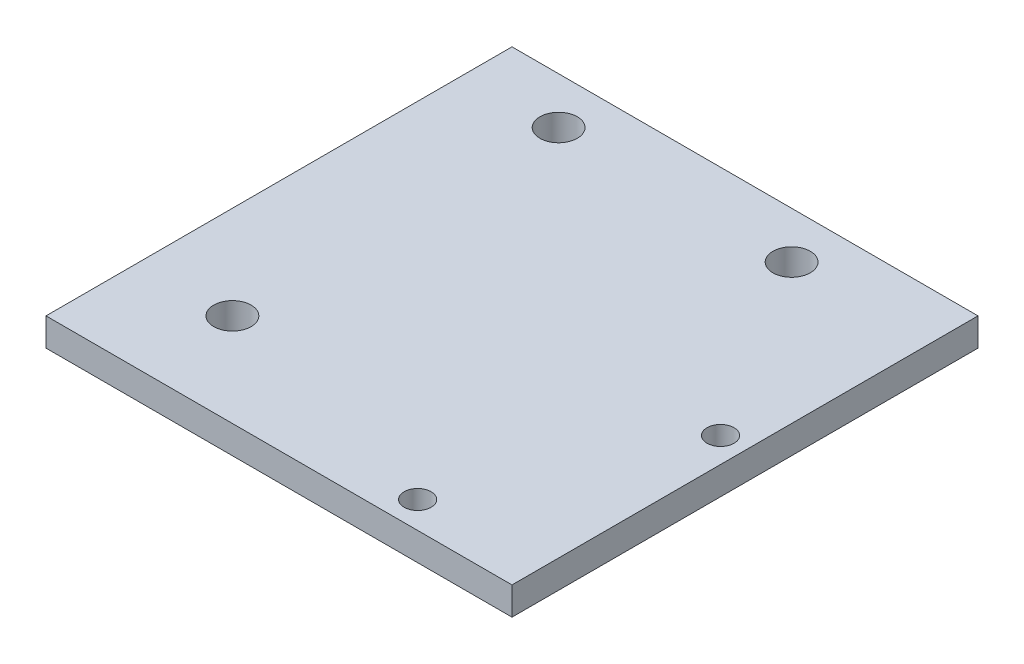
ISO-10303-21;
HEADER;
FILE_DESCRIPTION(('STEP AP214'),'2;1');
FILE_NAME('part.step','',(''),(''),'','','');
FILE_SCHEMA(('AUTOMOTIVE_DESIGN { 1 0 10303 214 1 1 1 1 }'));
ENDSEC;
DATA;
#1=APPLICATION_CONTEXT('core data for automotive mechanical design processes');
#2=APPLICATION_PROTOCOL_DEFINITION('international standard','automotive_design',2000,#1);
#3=PRODUCT_CONTEXT('',#1,'mechanical');
#4=PRODUCT('Part','Part','',(#3));
#5=PRODUCT_RELATED_PRODUCT_CATEGORY('part','',(#4));
#6=PRODUCT_DEFINITION_FORMATION('','',#4);
#7=PRODUCT_DEFINITION_CONTEXT('part definition',#1,'design');
#8=PRODUCT_DEFINITION('design','',#6,#7);
#9=PRODUCT_DEFINITION_SHAPE('','',#8);
#10=(LENGTH_UNIT() NAMED_UNIT(*) SI_UNIT(.MILLI.,.METRE.));
#11=(NAMED_UNIT(*) PLANE_ANGLE_UNIT() SI_UNIT($,.RADIAN.));
#12=(NAMED_UNIT(*) SI_UNIT($,.STERADIAN.) SOLID_ANGLE_UNIT());
#13=UNCERTAINTY_MEASURE_WITH_UNIT(LENGTH_MEASURE(1.E-05),#10,'distance_accuracy_value','');
#14=(GEOMETRIC_REPRESENTATION_CONTEXT(3) GLOBAL_UNCERTAINTY_ASSIGNED_CONTEXT((#13)) GLOBAL_UNIT_ASSIGNED_CONTEXT((#10,
#11,#12)) REPRESENTATION_CONTEXT('',''));
#15=CARTESIAN_POINT('',(0.,0.,0.));
#16=DIRECTION('',(0.,0.,1.));
#17=DIRECTION('',(1.,0.,0.));
#18=AXIS2_PLACEMENT_3D('',#15,#16,#17);
#19=CARTESIAN_POINT('',(0.,3.,0.));
#20=DIRECTION('',(1.,0.,0.));
#21=DIRECTION('',(0.,0.,-1.));
#22=AXIS2_PLACEMENT_3D('',#19,#20,#21);
#23=PLANE('',#22);
#24=DIRECTION('',(0.,0.,1.));
#25=VECTOR('',#24,1.);
#26=CARTESIAN_POINT('',(0.,0.,0.));
#27=LINE('',#26,#25);
#28=CARTESIAN_POINT('',(0.,0.,-50.));
#29=VERTEX_POINT('',#28);
#30=CARTESIAN_POINT('',(0.,0.,0.));
#31=VERTEX_POINT('',#30);
#32=EDGE_CURVE('E96',#29,#31,#27,.T.);
#33=ORIENTED_EDGE('',*,*,#32,.T.);
#34=DIRECTION('',(0.,-1.,0.));
#35=VECTOR('',#34,1.);
#36=CARTESIAN_POINT('',(0.,3.,0.));
#37=LINE('',#36,#35);
#38=CARTESIAN_POINT('',(0.,3.,0.));
#39=VERTEX_POINT('',#38);
#40=EDGE_CURVE('E11',#39,#31,#37,.T.);
#41=ORIENTED_EDGE('',*,*,#40,.F.);
#42=DIRECTION('',(0.,0.,1.));
#43=VECTOR('',#42,1.);
#44=CARTESIAN_POINT('',(0.,3.,0.));
#45=LINE('',#44,#43);
#46=CARTESIAN_POINT('',(0.,3.,-50.));
#47=VERTEX_POINT('',#46);
#48=EDGE_CURVE('E84',#47,#39,#45,.T.);
#49=ORIENTED_EDGE('',*,*,#48,.F.);
#50=DIRECTION('',(0.,-1.,0.));
#51=VECTOR('',#50,1.);
#52=CARTESIAN_POINT('',(0.,3.,-50.));
#53=LINE('',#52,#51);
#54=EDGE_CURVE('E92',#47,#29,#53,.T.);
#55=ORIENTED_EDGE('',*,*,#54,.T.);
#56=EDGE_LOOP('',(#33,#41,#49,#55));
#57=FACE_BOUND('',#56,.T.);
#58=ADVANCED_FACE('F33',(#57),#23,.F.);
#59=CARTESIAN_POINT('',(0.,3.,0.));
#60=DIRECTION('',(0.,0.,-1.));
#61=DIRECTION('',(-1.,0.,0.));
#62=AXIS2_PLACEMENT_3D('',#59,#60,#61);
#63=PLANE('',#62);
#64=DIRECTION('',(1.,0.,0.));
#65=VECTOR('',#64,1.);
#66=CARTESIAN_POINT('',(0.,0.,0.));
#67=LINE('',#66,#65);
#68=CARTESIAN_POINT('',(50.,0.,0.));
#69=VERTEX_POINT('',#68);
#70=EDGE_CURVE('E88',#31,#69,#67,.T.);
#71=ORIENTED_EDGE('',*,*,#70,.T.);
#72=DIRECTION('',(0.,-1.,0.));
#73=VECTOR('',#72,1.);
#74=CARTESIAN_POINT('',(50.,3.,0.));
#75=LINE('',#74,#73);
#76=CARTESIAN_POINT('',(50.,3.,0.));
#77=VERTEX_POINT('',#76);
#78=EDGE_CURVE('E41',#77,#69,#75,.T.);
#79=ORIENTED_EDGE('',*,*,#78,.F.);
#80=DIRECTION('',(1.,0.,0.));
#81=VECTOR('',#80,1.);
#82=CARTESIAN_POINT('',(0.,3.,0.));
#83=LINE('',#82,#81);
#84=EDGE_CURVE('E79',#39,#77,#83,.T.);
#85=ORIENTED_EDGE('',*,*,#84,.F.);
#86=ORIENTED_EDGE('',*,*,#40,.T.);
#87=EDGE_LOOP('',(#71,#79,#85,#86));
#88=FACE_BOUND('',#87,.T.);
#89=ADVANCED_FACE('F87',(#88),#63,.F.);
#90=CARTESIAN_POINT('',(50.,3.,0.));
#91=DIRECTION('',(-1.,0.,0.));
#92=DIRECTION('',(0.,0.,1.));
#93=AXIS2_PLACEMENT_3D('',#90,#91,#92);
#94=PLANE('',#93);
#95=DIRECTION('',(0.,0.,-1.));
#96=VECTOR('',#95,1.);
#97=CARTESIAN_POINT('',(50.,0.,0.));
#98=LINE('',#97,#96);
#99=CARTESIAN_POINT('',(50.,0.,-50.));
#100=VERTEX_POINT('',#99);
#101=EDGE_CURVE('E66',#69,#100,#98,.T.);
#102=ORIENTED_EDGE('',*,*,#101,.T.);
#103=DIRECTION('',(0.,-1.,0.));
#104=VECTOR('',#103,1.);
#105=CARTESIAN_POINT('',(50.,3.,-50.));
#106=LINE('',#105,#104);
#107=CARTESIAN_POINT('',(50.,3.,-50.));
#108=VERTEX_POINT('',#107);
#109=EDGE_CURVE('E89',#108,#100,#106,.T.);
#110=ORIENTED_EDGE('',*,*,#109,.F.);
#111=DIRECTION('',(0.,0.,-1.));
#112=VECTOR('',#111,1.);
#113=CARTESIAN_POINT('',(50.,3.,0.));
#114=LINE('',#113,#112);
#115=EDGE_CURVE('E82',#77,#108,#114,.T.);
#116=ORIENTED_EDGE('',*,*,#115,.F.);
#117=ORIENTED_EDGE('',*,*,#78,.T.);
#118=EDGE_LOOP('',(#102,#110,#116,#117));
#119=FACE_BOUND('',#118,.T.);
#120=ADVANCED_FACE('F90',(#119),#94,.F.);
#121=CARTESIAN_POINT('',(0.,3.,-50.));
#122=DIRECTION('',(0.,0.,1.));
#123=DIRECTION('',(1.,0.,0.));
#124=AXIS2_PLACEMENT_3D('',#121,#122,#123);
#125=PLANE('',#124);
#126=DIRECTION('',(-1.,0.,0.));
#127=VECTOR('',#126,1.);
#128=CARTESIAN_POINT('',(0.,0.,-50.));
#129=LINE('',#128,#127);
#130=EDGE_CURVE('E72',#100,#29,#129,.T.);
#131=ORIENTED_EDGE('',*,*,#130,.T.);
#132=ORIENTED_EDGE('',*,*,#54,.F.);
#133=DIRECTION('',(-1.,0.,0.));
#134=VECTOR('',#133,1.);
#135=CARTESIAN_POINT('',(0.,3.,-50.));
#136=LINE('',#135,#134);
#137=EDGE_CURVE('E49',#108,#47,#136,.T.);
#138=ORIENTED_EDGE('',*,*,#137,.F.);
#139=ORIENTED_EDGE('',*,*,#109,.T.);
#140=EDGE_LOOP('',(#131,#132,#138,#139));
#141=FACE_BOUND('',#140,.T.);
#142=ADVANCED_FACE('F104',(#141),#125,.F.);
#143=CARTESIAN_POINT('',(0.,3.,0.));
#144=DIRECTION('',(0.,-1.,0.));
#145=DIRECTION('',(0.,0.,-1.));
#146=AXIS2_PLACEMENT_3D('',#143,#144,#145);
#147=PLANE('',#146);
#148=CARTESIAN_POINT('',(37.0017114518645,3.,-2.8739211061672));
#149=DIRECTION('',(0.,1.,0.));
#150=DIRECTION('',(0.,0.,1.));
#151=AXIS2_PLACEMENT_3D('',#148,#149,#150);
#152=CIRCLE('',#151,1.45);
#153=CARTESIAN_POINT('',(37.0017114518645,3.,-1.4239211061672));
#154=VERTEX_POINT('',#153);
#155=EDGE_CURVE('E131',#154,#154,#152,.T.);
#156=ORIENTED_EDGE('',*,*,#155,.F.);
#157=EDGE_LOOP('',(#156));
#158=FACE_BOUND('',#157,.T.);
#159=CARTESIAN_POINT('',(47.3017114518645,3.,-25.0739211061672));
#160=DIRECTION('',(0.,1.,0.));
#161=DIRECTION('',(0.,0.,1.));
#162=AXIS2_PLACEMENT_3D('',#159,#160,#161);
#163=CIRCLE('',#162,1.45);
#164=CARTESIAN_POINT('',(47.3017114518645,3.,-23.6239211061672));
#165=VERTEX_POINT('',#164);
#166=EDGE_CURVE('E125',#165,#165,#163,.T.);
#167=ORIENTED_EDGE('',*,*,#166,.F.);
#168=EDGE_LOOP('',(#167));
#169=FACE_BOUND('',#168,.T.);
#170=CARTESIAN_POINT('',(10.,3.,-10.));
#171=DIRECTION('',(0.,1.,0.));
#172=DIRECTION('',(0.,0.,1.));
#173=AXIS2_PLACEMENT_3D('',#170,#171,#172);
#174=CIRCLE('',#173,2.0066);
#175=CARTESIAN_POINT('',(10.,3.,-7.9934));
#176=VERTEX_POINT('',#175);
#177=EDGE_CURVE('E122',#176,#176,#174,.T.);
#178=ORIENTED_EDGE('',*,*,#177,.F.);
#179=EDGE_LOOP('',(#178));
#180=FACE_BOUND('',#179,.T.);
#181=CARTESIAN_POINT('',(35.,3.,-45.));
#182=DIRECTION('',(0.,1.,0.));
#183=DIRECTION('',(0.,0.,1.));
#184=AXIS2_PLACEMENT_3D('',#181,#182,#183);
#185=CIRCLE('',#184,2.0066);
#186=CARTESIAN_POINT('',(35.,3.,-42.9934));
#187=VERTEX_POINT('',#186);
#188=EDGE_CURVE('E116',#187,#187,#185,.T.);
#189=ORIENTED_EDGE('',*,*,#188,.F.);
#190=EDGE_LOOP('',(#189));
#191=FACE_BOUND('',#190,.T.);
#192=CARTESIAN_POINT('',(10.,3.,-45.));
#193=DIRECTION('',(0.,1.,0.));
#194=DIRECTION('',(0.,0.,1.));
#195=AXIS2_PLACEMENT_3D('',#192,#193,#194);
#196=CIRCLE('',#195,2.0066);
#197=CARTESIAN_POINT('',(10.,3.,-42.9934));
#198=VERTEX_POINT('',#197);
#199=EDGE_CURVE('E110',#198,#198,#196,.T.);
#200=ORIENTED_EDGE('',*,*,#199,.F.);
#201=EDGE_LOOP('',(#200));
#202=FACE_BOUND('',#201,.T.);
#203=ORIENTED_EDGE('',*,*,#48,.T.);
#204=ORIENTED_EDGE('',*,*,#84,.T.);
#205=ORIENTED_EDGE('',*,*,#115,.T.);
#206=ORIENTED_EDGE('',*,*,#137,.T.);
#207=EDGE_LOOP('',(#203,#204,#205,#206));
#208=FACE_BOUND('',#207,.T.);
#209=ADVANCED_FACE('F80',(#158,#169,#180,#191,#202,#208),#147,.F.);
#210=CARTESIAN_POINT('',(0.,0.,0.));
#211=DIRECTION('',(0.,-1.,0.));
#212=DIRECTION('',(0.,0.,-1.));
#213=AXIS2_PLACEMENT_3D('',#210,#211,#212);
#214=PLANE('',#213);
#215=CARTESIAN_POINT('',(37.0017114518645,0.,-2.8739211061672));
#216=DIRECTION('',(0.,-1.,0.));
#217=DIRECTION('',(0.,0.,-1.));
#218=AXIS2_PLACEMENT_3D('',#215,#216,#217);
#219=CIRCLE('',#218,1.45);
#220=CARTESIAN_POINT('',(37.0017114518645,0.,-4.3239211061672));
#221=VERTEX_POINT('',#220);
#222=EDGE_CURVE('E134',#221,#221,#219,.F.);
#223=ORIENTED_EDGE('',*,*,#222,.T.);
#224=EDGE_LOOP('',(#223));
#225=FACE_BOUND('',#224,.T.);
#226=CARTESIAN_POINT('',(47.3017114518645,0.,-25.0739211061672));
#227=DIRECTION('',(0.,-1.,0.));
#228=DIRECTION('',(0.,0.,-1.));
#229=AXIS2_PLACEMENT_3D('',#226,#227,#228);
#230=CIRCLE('',#229,1.45);
#231=CARTESIAN_POINT('',(47.3017114518645,0.,-26.5239211061672));
#232=VERTEX_POINT('',#231);
#233=EDGE_CURVE('E128',#232,#232,#230,.F.);
#234=ORIENTED_EDGE('',*,*,#233,.T.);
#235=EDGE_LOOP('',(#234));
#236=FACE_BOUND('',#235,.T.);
#237=CARTESIAN_POINT('',(10.,0.,-10.));
#238=DIRECTION('',(0.,1.,0.));
#239=DIRECTION('',(0.,0.,1.));
#240=AXIS2_PLACEMENT_3D('',#237,#238,#239);
#241=CIRCLE('',#240,2.0066);
#242=CARTESIAN_POINT('',(10.,0.,-7.9934));
#243=VERTEX_POINT('',#242);
#244=EDGE_CURVE('E119',#243,#243,#241,.T.);
#245=ORIENTED_EDGE('',*,*,#244,.T.);
#246=EDGE_LOOP('',(#245));
#247=FACE_BOUND('',#246,.T.);
#248=CARTESIAN_POINT('',(35.,0.,-45.));
#249=DIRECTION('',(0.,1.,0.));
#250=DIRECTION('',(0.,0.,1.));
#251=AXIS2_PLACEMENT_3D('',#248,#249,#250);
#252=CIRCLE('',#251,2.0066);
#253=CARTESIAN_POINT('',(35.,0.,-42.9934));
#254=VERTEX_POINT('',#253);
#255=EDGE_CURVE('E113',#254,#254,#252,.T.);
#256=ORIENTED_EDGE('',*,*,#255,.T.);
#257=EDGE_LOOP('',(#256));
#258=FACE_BOUND('',#257,.T.);
#259=CARTESIAN_POINT('',(10.,0.,-45.));
#260=DIRECTION('',(0.,1.,0.));
#261=DIRECTION('',(0.,0.,1.));
#262=AXIS2_PLACEMENT_3D('',#259,#260,#261);
#263=CIRCLE('',#262,2.0066);
#264=CARTESIAN_POINT('',(10.,0.,-42.9934));
#265=VERTEX_POINT('',#264);
#266=EDGE_CURVE('E99',#265,#265,#263,.T.);
#267=ORIENTED_EDGE('',*,*,#266,.T.);
#268=EDGE_LOOP('',(#267));
#269=FACE_BOUND('',#268,.T.);
#270=ORIENTED_EDGE('',*,*,#32,.F.);
#271=ORIENTED_EDGE('',*,*,#130,.F.);
#272=ORIENTED_EDGE('',*,*,#101,.F.);
#273=ORIENTED_EDGE('',*,*,#70,.F.);
#274=EDGE_LOOP('',(#270,#271,#272,#273));
#275=FACE_BOUND('',#274,.T.);
#276=ADVANCED_FACE('F107',(#225,#236,#247,#258,#269,#275),#214,.T.);
#277=CARTESIAN_POINT('',(10.,0.,-45.));
#278=DIRECTION('',(0.,1.,0.));
#279=DIRECTION('',(0.,0.,1.));
#280=AXIS2_PLACEMENT_3D('',#277,#278,#279);
#281=CYLINDRICAL_SURFACE('',#280,2.0066);
#282=ORIENTED_EDGE('',*,*,#266,.F.);
#283=EDGE_LOOP('',(#282));
#284=FACE_BOUND('',#283,.T.);
#285=ORIENTED_EDGE('',*,*,#199,.T.);
#286=EDGE_LOOP('',(#285));
#287=FACE_BOUND('',#286,.T.);
#288=ADVANCED_FACE('F153',(#284,#287),#281,.F.);
#289=CARTESIAN_POINT('',(35.,0.,-45.));
#290=DIRECTION('',(0.,1.,0.));
#291=DIRECTION('',(0.,0.,1.));
#292=AXIS2_PLACEMENT_3D('',#289,#290,#291);
#293=CYLINDRICAL_SURFACE('',#292,2.0066);
#294=ORIENTED_EDGE('',*,*,#255,.F.);
#295=EDGE_LOOP('',(#294));
#296=FACE_BOUND('',#295,.T.);
#297=ORIENTED_EDGE('',*,*,#188,.T.);
#298=EDGE_LOOP('',(#297));
#299=FACE_BOUND('',#298,.T.);
#300=ADVANCED_FACE('F155',(#296,#299),#293,.F.);
#301=CARTESIAN_POINT('',(10.,0.,-10.));
#302=DIRECTION('',(0.,1.,0.));
#303=DIRECTION('',(0.,0.,1.));
#304=AXIS2_PLACEMENT_3D('',#301,#302,#303);
#305=CYLINDRICAL_SURFACE('',#304,2.0066);
#306=ORIENTED_EDGE('',*,*,#244,.F.);
#307=EDGE_LOOP('',(#306));
#308=FACE_BOUND('',#307,.T.);
#309=ORIENTED_EDGE('',*,*,#177,.T.);
#310=EDGE_LOOP('',(#309));
#311=FACE_BOUND('',#310,.T.);
#312=ADVANCED_FACE('F162',(#308,#311),#305,.F.);
#313=CARTESIAN_POINT('',(47.3017114518645,-0.00100000000000013,-25.0739211061672));
#314=DIRECTION('',(0.,1.,0.));
#315=DIRECTION('',(0.,0.,1.));
#316=AXIS2_PLACEMENT_3D('',#313,#314,#315);
#317=CYLINDRICAL_SURFACE('',#316,1.45);
#318=ORIENTED_EDGE('',*,*,#233,.F.);
#319=EDGE_LOOP('',(#318));
#320=FACE_BOUND('',#319,.T.);
#321=ORIENTED_EDGE('',*,*,#166,.T.);
#322=EDGE_LOOP('',(#321));
#323=FACE_BOUND('',#322,.T.);
#324=ADVANCED_FACE('F199',(#320,#323),#317,.F.);
#325=CARTESIAN_POINT('',(37.0017114518645,-0.00100000000000013,-2.8739211061672));
#326=DIRECTION('',(0.,1.,0.));
#327=DIRECTION('',(0.,0.,1.));
#328=AXIS2_PLACEMENT_3D('',#325,#326,#327);
#329=CYLINDRICAL_SURFACE('',#328,1.45);
#330=ORIENTED_EDGE('',*,*,#222,.F.);
#331=EDGE_LOOP('',(#330));
#332=FACE_BOUND('',#331,.T.);
#333=ORIENTED_EDGE('',*,*,#155,.T.);
#334=EDGE_LOOP('',(#333));
#335=FACE_BOUND('',#334,.T.);
#336=ADVANCED_FACE('F140',(#332,#335),#329,.F.);
#337=CLOSED_SHELL('',(#58,#89,#120,#142,#209,#276,#288,#300,#312,#324,#336));
#338=MANIFOLD_SOLID_BREP('B2',#337);
#339=ADVANCED_BREP_SHAPE_REPRESENTATION('',(#18,#338),#14);
#340=SHAPE_DEFINITION_REPRESENTATION(#9,#339);
ENDSEC;
END-ISO-10303-21;
